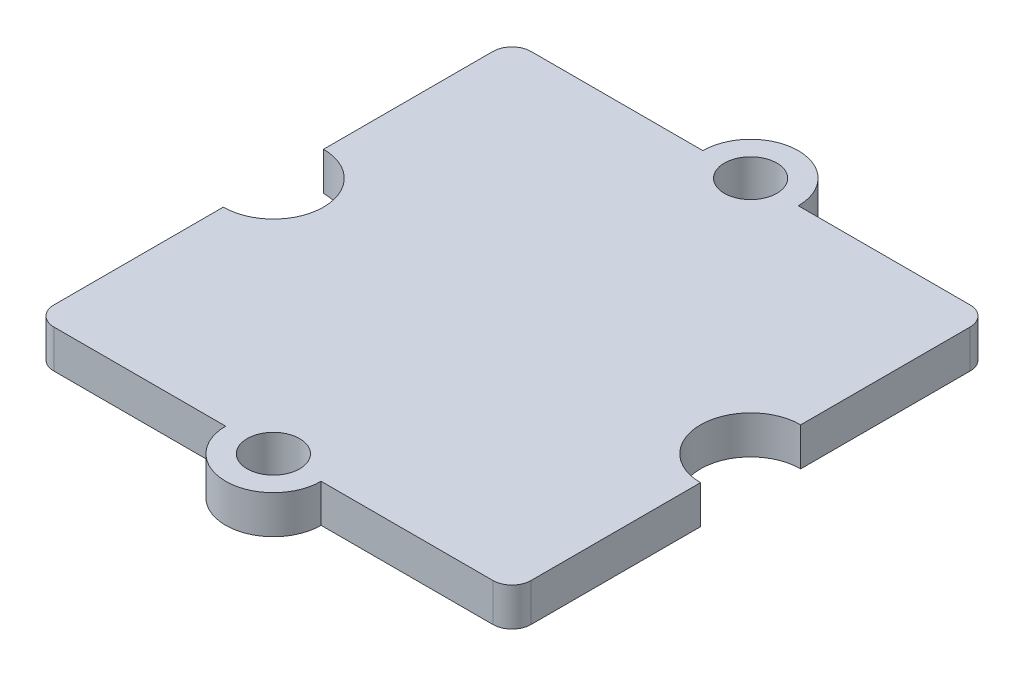
ISO-10303-21;
HEADER;
FILE_DESCRIPTION(('STEP AP214'),'2;1');
FILE_NAME('part.step','',(''),(''),'','','');
FILE_SCHEMA(('AUTOMOTIVE_DESIGN { 1 0 10303 214 1 1 1 1 }'));
ENDSEC;
DATA;
#1=APPLICATION_CONTEXT('core data for automotive mechanical design processes');
#2=APPLICATION_PROTOCOL_DEFINITION('international standard','automotive_design',2000,#1);
#3=PRODUCT_CONTEXT('',#1,'mechanical');
#4=PRODUCT('Part','Part','',(#3));
#5=PRODUCT_RELATED_PRODUCT_CATEGORY('part','',(#4));
#6=PRODUCT_DEFINITION_FORMATION('','',#4);
#7=PRODUCT_DEFINITION_CONTEXT('part definition',#1,'design');
#8=PRODUCT_DEFINITION('design','',#6,#7);
#9=PRODUCT_DEFINITION_SHAPE('','',#8);
#10=(LENGTH_UNIT() NAMED_UNIT(*) SI_UNIT(.MILLI.,.METRE.));
#11=(NAMED_UNIT(*) PLANE_ANGLE_UNIT() SI_UNIT($,.RADIAN.));
#12=(NAMED_UNIT(*) SI_UNIT($,.STERADIAN.) SOLID_ANGLE_UNIT());
#13=UNCERTAINTY_MEASURE_WITH_UNIT(LENGTH_MEASURE(1.E-05),#10,'distance_accuracy_value','');
#14=(GEOMETRIC_REPRESENTATION_CONTEXT(3) GLOBAL_UNCERTAINTY_ASSIGNED_CONTEXT((#13)) GLOBAL_UNIT_ASSIGNED_CONTEXT((#10,
#11,#12)) REPRESENTATION_CONTEXT('',''));
#15=CARTESIAN_POINT('',(0.,0.,0.));
#16=DIRECTION('',(0.,0.,1.));
#17=DIRECTION('',(1.,0.,0.));
#18=AXIS2_PLACEMENT_3D('',#15,#16,#17);
#19=CARTESIAN_POINT('',(0.,0.8,10.));
#20=DIRECTION('',(0.,-1.,0.));
#21=DIRECTION('',(0.,0.,-1.));
#22=AXIS2_PLACEMENT_3D('',#19,#20,#21);
#23=CYLINDRICAL_SURFACE('',#22,2.);
#24=CARTESIAN_POINT('',(0.,-0.8,10.));
#25=DIRECTION('',(0.,1.,0.));
#26=DIRECTION('',(0.,0.,1.));
#27=AXIS2_PLACEMENT_3D('',#24,#25,#26);
#28=CIRCLE('',#27,2.);
#29=CARTESIAN_POINT('',(-2.,-0.8,10.));
#30=VERTEX_POINT('',#29);
#31=CARTESIAN_POINT('',(2.,-0.8,10.));
#32=VERTEX_POINT('',#31);
#33=EDGE_CURVE('E189',#30,#32,#28,.T.);
#34=ORIENTED_EDGE('',*,*,#33,.T.);
#35=DIRECTION('',(0.,-1.,0.));
#36=VECTOR('',#35,1.);
#37=CARTESIAN_POINT('',(2.,0.8,10.));
#38=LINE('',#37,#36);
#39=CARTESIAN_POINT('',(2.,0.8,10.));
#40=VERTEX_POINT('',#39);
#41=EDGE_CURVE('E11',#40,#32,#38,.T.);
#42=ORIENTED_EDGE('',*,*,#41,.F.);
#43=CARTESIAN_POINT('',(0.,0.8,10.));
#44=DIRECTION('',(0.,1.,0.));
#45=DIRECTION('',(0.,0.,1.));
#46=AXIS2_PLACEMENT_3D('',#43,#44,#45);
#47=CIRCLE('',#46,2.);
#48=CARTESIAN_POINT('',(-2.,0.8,10.));
#49=VERTEX_POINT('',#48);
#50=EDGE_CURVE('E230',#49,#40,#47,.T.);
#51=ORIENTED_EDGE('',*,*,#50,.F.);
#52=DIRECTION('',(0.,-1.,0.));
#53=VECTOR('',#52,1.);
#54=CARTESIAN_POINT('',(-2.,0.8,10.));
#55=LINE('',#54,#53);
#56=EDGE_CURVE('E188',#49,#30,#55,.T.);
#57=ORIENTED_EDGE('',*,*,#56,.T.);
#58=EDGE_LOOP('',(#34,#42,#51,#57));
#59=FACE_BOUND('',#58,.T.);
#60=ADVANCED_FACE('F38',(#59),#23,.T.);
#61=CARTESIAN_POINT('',(0.,0.8,10.));
#62=DIRECTION('',(0.,0.,-1.));
#63=DIRECTION('',(-1.,0.,0.));
#64=AXIS2_PLACEMENT_3D('',#61,#62,#63);
#65=PLANE('',#64);
#66=DIRECTION('',(1.,0.,0.));
#67=VECTOR('',#66,1.);
#68=CARTESIAN_POINT('',(0.,-0.8,10.));
#69=LINE('',#68,#67);
#70=CARTESIAN_POINT('',(9.2,-0.8,10.));
#71=VERTEX_POINT('',#70);
#72=EDGE_CURVE('E192',#32,#71,#69,.T.);
#73=ORIENTED_EDGE('',*,*,#72,.T.);
#74=DIRECTION('',(0.,-1.,0.));
#75=VECTOR('',#74,1.);
#76=CARTESIAN_POINT('',(9.2,0.8,10.));
#77=LINE('',#76,#75);
#78=CARTESIAN_POINT('',(9.2,0.8,10.));
#79=VERTEX_POINT('',#78);
#80=EDGE_CURVE('E46',#79,#71,#77,.T.);
#81=ORIENTED_EDGE('',*,*,#80,.F.);
#82=DIRECTION('',(1.,0.,0.));
#83=VECTOR('',#82,1.);
#84=CARTESIAN_POINT('',(0.,0.8,10.));
#85=LINE('',#84,#83);
#86=EDGE_CURVE('E117',#40,#79,#85,.T.);
#87=ORIENTED_EDGE('',*,*,#86,.F.);
#88=ORIENTED_EDGE('',*,*,#41,.T.);
#89=EDGE_LOOP('',(#73,#81,#87,#88));
#90=FACE_BOUND('',#89,.T.);
#91=ADVANCED_FACE('F310',(#90),#65,.F.);
#92=CARTESIAN_POINT('',(9.2,0.8,9.2));
#93=DIRECTION('',(0.,-1.,0.));
#94=DIRECTION('',(0.,0.,-1.));
#95=AXIS2_PLACEMENT_3D('',#92,#93,#94);
#96=CYLINDRICAL_SURFACE('',#95,0.800000000000001);
#97=CARTESIAN_POINT('',(9.2,-0.8,9.2));
#98=DIRECTION('',(0.,1.,0.));
#99=DIRECTION('',(0.,0.,1.));
#100=AXIS2_PLACEMENT_3D('',#97,#98,#99);
#101=CIRCLE('',#100,0.800000000000001);
#102=CARTESIAN_POINT('',(10.,-0.8,9.2));
#103=VERTEX_POINT('',#102);
#104=EDGE_CURVE('E194',#71,#103,#101,.T.);
#105=ORIENTED_EDGE('',*,*,#104,.T.);
#106=DIRECTION('',(0.,-1.,0.));
#107=VECTOR('',#106,1.);
#108=CARTESIAN_POINT('',(10.,0.8,9.2));
#109=LINE('',#108,#107);
#110=CARTESIAN_POINT('',(10.,0.8,9.2));
#111=VERTEX_POINT('',#110);
#112=EDGE_CURVE('E252',#111,#103,#109,.T.);
#113=ORIENTED_EDGE('',*,*,#112,.F.);
#114=CARTESIAN_POINT('',(9.2,0.8,9.2));
#115=DIRECTION('',(0.,1.,0.));
#116=DIRECTION('',(0.,0.,1.));
#117=AXIS2_PLACEMENT_3D('',#114,#115,#116);
#118=CIRCLE('',#117,0.800000000000001);
#119=EDGE_CURVE('E260',#79,#111,#118,.T.);
#120=ORIENTED_EDGE('',*,*,#119,.F.);
#121=ORIENTED_EDGE('',*,*,#80,.T.);
#122=EDGE_LOOP('',(#105,#113,#120,#121));
#123=FACE_BOUND('',#122,.T.);
#124=ADVANCED_FACE('F258',(#123),#96,.T.);
#125=CARTESIAN_POINT('',(10.,0.8,0.));
#126=DIRECTION('',(-1.,0.,0.));
#127=DIRECTION('',(0.,0.,1.));
#128=AXIS2_PLACEMENT_3D('',#125,#126,#127);
#129=PLANE('',#128);
#130=DIRECTION('',(0.,0.,-1.));
#131=VECTOR('',#130,1.);
#132=CARTESIAN_POINT('',(10.,-0.8,0.));
#133=LINE('',#132,#131);
#134=CARTESIAN_POINT('',(10.,-0.8,2.10000000000001));
#135=VERTEX_POINT('',#134);
#136=EDGE_CURVE('E196',#103,#135,#133,.T.);
#137=ORIENTED_EDGE('',*,*,#136,.T.);
#138=DIRECTION('',(0.,-1.,0.));
#139=VECTOR('',#138,1.);
#140=CARTESIAN_POINT('',(10.,0.8,2.10000000000001));
#141=LINE('',#140,#139);
#142=CARTESIAN_POINT('',(10.,0.8,2.10000000000001));
#143=VERTEX_POINT('',#142);
#144=EDGE_CURVE('E250',#143,#135,#141,.T.);
#145=ORIENTED_EDGE('',*,*,#144,.F.);
#146=DIRECTION('',(0.,0.,-1.));
#147=VECTOR('',#146,1.);
#148=CARTESIAN_POINT('',(10.,0.8,0.));
#149=LINE('',#148,#147);
#150=EDGE_CURVE('E273',#111,#143,#149,.T.);
#151=ORIENTED_EDGE('',*,*,#150,.F.);
#152=ORIENTED_EDGE('',*,*,#112,.T.);
#153=EDGE_LOOP('',(#137,#145,#151,#152));
#154=FACE_BOUND('',#153,.T.);
#155=ADVANCED_FACE('F270',(#154),#129,.F.);
#156=CARTESIAN_POINT('',(10.,0.8,0.));
#157=DIRECTION('',(0.,-1.,0.));
#158=DIRECTION('',(0.,0.,-1.));
#159=AXIS2_PLACEMENT_3D('',#156,#157,#158);
#160=CYLINDRICAL_SURFACE('',#159,2.1);
#161=CARTESIAN_POINT('',(10.,-0.8,0.));
#162=DIRECTION('',(0.,1.,0.));
#163=DIRECTION('',(0.,0.,1.));
#164=AXIS2_PLACEMENT_3D('',#161,#162,#163);
#165=CIRCLE('',#164,2.1);
#166=CARTESIAN_POINT('',(10.,-0.8,-2.09999999999999));
#167=VERTEX_POINT('',#166);
#168=EDGE_CURVE('E199',#167,#135,#165,.T.);
#169=ORIENTED_EDGE('',*,*,#168,.F.);
#170=DIRECTION('',(0.,-1.,0.));
#171=VECTOR('',#170,1.);
#172=CARTESIAN_POINT('',(10.,0.8,-2.09999999999999));
#173=LINE('',#172,#171);
#174=CARTESIAN_POINT('',(10.,0.8,-2.09999999999999));
#175=VERTEX_POINT('',#174);
#176=EDGE_CURVE('E248',#175,#167,#173,.T.);
#177=ORIENTED_EDGE('',*,*,#176,.F.);
#178=CARTESIAN_POINT('',(10.,0.8,0.));
#179=DIRECTION('',(0.,1.,0.));
#180=DIRECTION('',(0.,0.,1.));
#181=AXIS2_PLACEMENT_3D('',#178,#179,#180);
#182=CIRCLE('',#181,2.1);
#183=EDGE_CURVE('E275',#175,#143,#182,.T.);
#184=ORIENTED_EDGE('',*,*,#183,.T.);
#185=ORIENTED_EDGE('',*,*,#144,.T.);
#186=EDGE_LOOP('',(#169,#177,#184,#185));
#187=FACE_BOUND('',#186,.T.);
#188=ADVANCED_FACE('F339',(#187),#160,.F.);
#189=CARTESIAN_POINT('',(10.,-0.8,-9.20000000000001));
#190=VERTEX_POINT('',#189);
#191=EDGE_CURVE('E200',#167,#190,#133,.T.);
#192=ORIENTED_EDGE('',*,*,#191,.T.);
#193=DIRECTION('',(0.,-1.,0.));
#194=VECTOR('',#193,1.);
#195=CARTESIAN_POINT('',(10.,0.8,-9.20000000000001));
#196=LINE('',#195,#194);
#197=CARTESIAN_POINT('',(10.,0.8,-9.20000000000001));
#198=VERTEX_POINT('',#197);
#199=EDGE_CURVE('E246',#198,#190,#196,.T.);
#200=ORIENTED_EDGE('',*,*,#199,.F.);
#201=EDGE_CURVE('E277',#175,#198,#149,.T.);
#202=ORIENTED_EDGE('',*,*,#201,.F.);
#203=ORIENTED_EDGE('',*,*,#176,.T.);
#204=EDGE_LOOP('',(#192,#200,#202,#203));
#205=FACE_BOUND('',#204,.T.);
#206=ADVANCED_FACE('F341',(#205),#129,.F.);
#207=CARTESIAN_POINT('',(9.2,0.8,-9.20000000000001));
#208=DIRECTION('',(0.,-1.,0.));
#209=DIRECTION('',(0.,0.,-1.));
#210=AXIS2_PLACEMENT_3D('',#207,#208,#209);
#211=CYLINDRICAL_SURFACE('',#210,0.800000000000002);
#212=CARTESIAN_POINT('',(9.2,-0.8,-9.20000000000001));
#213=DIRECTION('',(0.,1.,0.));
#214=DIRECTION('',(0.,0.,1.));
#215=AXIS2_PLACEMENT_3D('',#212,#213,#214);
#216=CIRCLE('',#215,0.800000000000002);
#217=CARTESIAN_POINT('',(9.2,-0.8,-10.));
#218=VERTEX_POINT('',#217);
#219=EDGE_CURVE('E203',#218,#190,#216,.F.);
#220=ORIENTED_EDGE('',*,*,#219,.F.);
#221=DIRECTION('',(0.,-1.,0.));
#222=VECTOR('',#221,1.);
#223=CARTESIAN_POINT('',(9.2,0.8,-10.));
#224=LINE('',#223,#222);
#225=CARTESIAN_POINT('',(9.2,0.8,-10.));
#226=VERTEX_POINT('',#225);
#227=EDGE_CURVE('E244',#226,#218,#224,.T.);
#228=ORIENTED_EDGE('',*,*,#227,.F.);
#229=CARTESIAN_POINT('',(9.2,0.8,-9.20000000000001));
#230=DIRECTION('',(0.,1.,0.));
#231=DIRECTION('',(0.,0.,1.));
#232=AXIS2_PLACEMENT_3D('',#229,#230,#231);
#233=CIRCLE('',#232,0.800000000000002);
#234=EDGE_CURVE('E280',#226,#198,#233,.F.);
#235=ORIENTED_EDGE('',*,*,#234,.T.);
#236=ORIENTED_EDGE('',*,*,#199,.T.);
#237=EDGE_LOOP('',(#220,#228,#235,#236));
#238=FACE_BOUND('',#237,.T.);
#239=ADVANCED_FACE('F354',(#238),#211,.T.);
#240=CARTESIAN_POINT('',(0.,0.8,-10.));
#241=DIRECTION('',(0.,0.,-1.));
#242=DIRECTION('',(-1.,0.,0.));
#243=AXIS2_PLACEMENT_3D('',#240,#241,#242);
#244=PLANE('',#243);
#245=DIRECTION('',(1.,0.,0.));
#246=VECTOR('',#245,1.);
#247=CARTESIAN_POINT('',(0.,-0.8,-10.));
#248=LINE('',#247,#246);
#249=CARTESIAN_POINT('',(2.,-0.8,-10.));
#250=VERTEX_POINT('',#249);
#251=EDGE_CURVE('E206',#250,#218,#248,.T.);
#252=ORIENTED_EDGE('',*,*,#251,.F.);
#253=DIRECTION('',(0.,-1.,0.));
#254=VECTOR('',#253,1.);
#255=CARTESIAN_POINT('',(2.,0.8,-10.));
#256=LINE('',#255,#254);
#257=CARTESIAN_POINT('',(2.,0.8,-10.));
#258=VERTEX_POINT('',#257);
#259=EDGE_CURVE('E242',#258,#250,#256,.T.);
#260=ORIENTED_EDGE('',*,*,#259,.F.);
#261=DIRECTION('',(1.,0.,0.));
#262=VECTOR('',#261,1.);
#263=CARTESIAN_POINT('',(0.,0.8,-10.));
#264=LINE('',#263,#262);
#265=EDGE_CURVE('E285',#258,#226,#264,.T.);
#266=ORIENTED_EDGE('',*,*,#265,.T.);
#267=ORIENTED_EDGE('',*,*,#227,.T.);
#268=EDGE_LOOP('',(#252,#260,#266,#267));
#269=FACE_BOUND('',#268,.T.);
#270=ADVANCED_FACE('F361',(#269),#244,.T.);
#271=CARTESIAN_POINT('',(0.,0.8,-9.99999999999999));
#272=DIRECTION('',(0.,-1.,0.));
#273=DIRECTION('',(0.,0.,-1.));
#274=AXIS2_PLACEMENT_3D('',#271,#272,#273);
#275=CYLINDRICAL_SURFACE('',#274,2.);
#276=CARTESIAN_POINT('',(0.,-0.8,-9.99999999999999));
#277=DIRECTION('',(0.,1.,0.));
#278=DIRECTION('',(0.,0.,1.));
#279=AXIS2_PLACEMENT_3D('',#276,#277,#278);
#280=CIRCLE('',#279,2.);
#281=CARTESIAN_POINT('',(-2.,-0.8,-10.));
#282=VERTEX_POINT('',#281);
#283=EDGE_CURVE('E209',#250,#282,#280,.T.);
#284=ORIENTED_EDGE('',*,*,#283,.T.);
#285=DIRECTION('',(0.,-1.,0.));
#286=VECTOR('',#285,1.);
#287=CARTESIAN_POINT('',(-2.,0.8,-10.));
#288=LINE('',#287,#286);
#289=CARTESIAN_POINT('',(-2.,0.8,-10.));
#290=VERTEX_POINT('',#289);
#291=EDGE_CURVE('E240',#290,#282,#288,.T.);
#292=ORIENTED_EDGE('',*,*,#291,.F.);
#293=CARTESIAN_POINT('',(0.,0.8,-9.99999999999999));
#294=DIRECTION('',(0.,1.,0.));
#295=DIRECTION('',(0.,0.,1.));
#296=AXIS2_PLACEMENT_3D('',#293,#294,#295);
#297=CIRCLE('',#296,2.);
#298=EDGE_CURVE('E289',#258,#290,#297,.T.);
#299=ORIENTED_EDGE('',*,*,#298,.F.);
#300=ORIENTED_EDGE('',*,*,#259,.T.);
#301=EDGE_LOOP('',(#284,#292,#299,#300));
#302=FACE_BOUND('',#301,.T.);
#303=ADVANCED_FACE('F368',(#302),#275,.T.);
#304=CARTESIAN_POINT('',(-9.2,-0.8,-10.));
#305=VERTEX_POINT('',#304);
#306=EDGE_CURVE('E210',#305,#282,#248,.T.);
#307=ORIENTED_EDGE('',*,*,#306,.F.);
#308=DIRECTION('',(0.,-1.,0.));
#309=VECTOR('',#308,1.);
#310=CARTESIAN_POINT('',(-9.2,0.8,-10.));
#311=LINE('',#310,#309);
#312=CARTESIAN_POINT('',(-9.2,0.8,-10.));
#313=VERTEX_POINT('',#312);
#314=EDGE_CURVE('E238',#313,#305,#311,.T.);
#315=ORIENTED_EDGE('',*,*,#314,.F.);
#316=EDGE_CURVE('E291',#313,#290,#264,.T.);
#317=ORIENTED_EDGE('',*,*,#316,.T.);
#318=ORIENTED_EDGE('',*,*,#291,.T.);
#319=EDGE_LOOP('',(#307,#315,#317,#318));
#320=FACE_BOUND('',#319,.T.);
#321=ADVANCED_FACE('F371',(#320),#244,.T.);
#322=CARTESIAN_POINT('',(-9.2,0.8,-9.20000000000001));
#323=DIRECTION('',(0.,-1.,0.));
#324=DIRECTION('',(0.,0.,-1.));
#325=AXIS2_PLACEMENT_3D('',#322,#323,#324);
#326=CYLINDRICAL_SURFACE('',#325,0.800000000000002);
#327=CARTESIAN_POINT('',(-9.2,-0.8,-9.20000000000001));
#328=DIRECTION('',(0.,1.,0.));
#329=DIRECTION('',(0.,0.,1.));
#330=AXIS2_PLACEMENT_3D('',#327,#328,#329);
#331=CIRCLE('',#330,0.800000000000002);
#332=CARTESIAN_POINT('',(-10.,-0.8,-9.20000000000001));
#333=VERTEX_POINT('',#332);
#334=EDGE_CURVE('E213',#333,#305,#331,.F.);
#335=ORIENTED_EDGE('',*,*,#334,.F.);
#336=DIRECTION('',(0.,-1.,0.));
#337=VECTOR('',#336,1.);
#338=CARTESIAN_POINT('',(-10.,0.8,-9.20000000000001));
#339=LINE('',#338,#337);
#340=CARTESIAN_POINT('',(-10.,0.8,-9.20000000000001));
#341=VERTEX_POINT('',#340);
#342=EDGE_CURVE('E236',#341,#333,#339,.T.);
#343=ORIENTED_EDGE('',*,*,#342,.F.);
#344=CARTESIAN_POINT('',(-9.2,0.8,-9.20000000000001));
#345=DIRECTION('',(0.,1.,0.));
#346=DIRECTION('',(0.,0.,1.));
#347=AXIS2_PLACEMENT_3D('',#344,#345,#346);
#348=CIRCLE('',#347,0.800000000000002);
#349=EDGE_CURVE('E294',#341,#313,#348,.F.);
#350=ORIENTED_EDGE('',*,*,#349,.T.);
#351=ORIENTED_EDGE('',*,*,#314,.T.);
#352=EDGE_LOOP('',(#335,#343,#350,#351));
#353=FACE_BOUND('',#352,.T.);
#354=ADVANCED_FACE('F384',(#353),#326,.T.);
#355=CARTESIAN_POINT('',(-10.,0.8,0.));
#356=DIRECTION('',(-1.,0.,0.));
#357=DIRECTION('',(0.,0.,1.));
#358=AXIS2_PLACEMENT_3D('',#355,#356,#357);
#359=PLANE('',#358);
#360=DIRECTION('',(0.,0.,-1.));
#361=VECTOR('',#360,1.);
#362=CARTESIAN_POINT('',(-10.,-0.8,0.));
#363=LINE('',#362,#361);
#364=CARTESIAN_POINT('',(-10.,-0.8,-2.09999999999999));
#365=VERTEX_POINT('',#364);
#366=EDGE_CURVE('E216',#365,#333,#363,.T.);
#367=ORIENTED_EDGE('',*,*,#366,.F.);
#368=DIRECTION('',(0.,-1.,0.));
#369=VECTOR('',#368,1.);
#370=CARTESIAN_POINT('',(-10.,0.8,-2.09999999999999));
#371=LINE('',#370,#369);
#372=CARTESIAN_POINT('',(-10.,0.8,-2.09999999999999));
#373=VERTEX_POINT('',#372);
#374=EDGE_CURVE('E234',#373,#365,#371,.T.);
#375=ORIENTED_EDGE('',*,*,#374,.F.);
#376=DIRECTION('',(0.,0.,-1.));
#377=VECTOR('',#376,1.);
#378=CARTESIAN_POINT('',(-10.,0.8,0.));
#379=LINE('',#378,#377);
#380=EDGE_CURVE('E176',#373,#341,#379,.T.);
#381=ORIENTED_EDGE('',*,*,#380,.T.);
#382=ORIENTED_EDGE('',*,*,#342,.T.);
#383=EDGE_LOOP('',(#367,#375,#381,#382));
#384=FACE_BOUND('',#383,.T.);
#385=ADVANCED_FACE('F391',(#384),#359,.T.);
#386=CARTESIAN_POINT('',(-10.,0.8,0.));
#387=DIRECTION('',(0.,-1.,0.));
#388=DIRECTION('',(0.,0.,-1.));
#389=AXIS2_PLACEMENT_3D('',#386,#387,#388);
#390=CYLINDRICAL_SURFACE('',#389,2.1);
#391=CARTESIAN_POINT('',(-10.,-0.8,0.));
#392=DIRECTION('',(0.,1.,0.));
#393=DIRECTION('',(0.,0.,1.));
#394=AXIS2_PLACEMENT_3D('',#391,#392,#393);
#395=CIRCLE('',#394,2.1);
#396=CARTESIAN_POINT('',(-10.,-0.8,2.10000000000001));
#397=VERTEX_POINT('',#396);
#398=EDGE_CURVE('E219',#397,#365,#395,.T.);
#399=ORIENTED_EDGE('',*,*,#398,.F.);
#400=DIRECTION('',(0.,-1.,0.));
#401=VECTOR('',#400,1.);
#402=CARTESIAN_POINT('',(-10.,0.8,2.10000000000001));
#403=LINE('',#402,#401);
#404=CARTESIAN_POINT('',(-10.,0.8,2.10000000000001));
#405=VERTEX_POINT('',#404);
#406=EDGE_CURVE('E166',#405,#397,#403,.T.);
#407=ORIENTED_EDGE('',*,*,#406,.F.);
#408=CARTESIAN_POINT('',(-10.,0.8,0.));
#409=DIRECTION('',(0.,1.,0.));
#410=DIRECTION('',(0.,0.,1.));
#411=AXIS2_PLACEMENT_3D('',#408,#409,#410);
#412=CIRCLE('',#411,2.1);
#413=EDGE_CURVE('E174',#405,#373,#412,.T.);
#414=ORIENTED_EDGE('',*,*,#413,.T.);
#415=ORIENTED_EDGE('',*,*,#374,.T.);
#416=EDGE_LOOP('',(#399,#407,#414,#415));
#417=FACE_BOUND('',#416,.T.);
#418=ADVANCED_FACE('F300',(#417),#390,.F.);
#419=CARTESIAN_POINT('',(-10.,-0.8,9.2));
#420=VERTEX_POINT('',#419);
#421=EDGE_CURVE('E161',#420,#397,#363,.T.);
#422=ORIENTED_EDGE('',*,*,#421,.F.);
#423=DIRECTION('',(0.,-1.,0.));
#424=VECTOR('',#423,1.);
#425=CARTESIAN_POINT('',(-10.,0.8,9.2));
#426=LINE('',#425,#424);
#427=CARTESIAN_POINT('',(-10.,0.8,9.2));
#428=VERTEX_POINT('',#427);
#429=EDGE_CURVE('E156',#428,#420,#426,.T.);
#430=ORIENTED_EDGE('',*,*,#429,.F.);
#431=EDGE_CURVE('E159',#428,#405,#379,.T.);
#432=ORIENTED_EDGE('',*,*,#431,.T.);
#433=ORIENTED_EDGE('',*,*,#406,.T.);
#434=EDGE_LOOP('',(#422,#430,#432,#433));
#435=FACE_BOUND('',#434,.T.);
#436=ADVANCED_FACE('F158',(#435),#359,.T.);
#437=CARTESIAN_POINT('',(-9.19999999999999,0.8,9.2));
#438=DIRECTION('',(0.,-1.,0.));
#439=DIRECTION('',(0.,0.,-1.));
#440=AXIS2_PLACEMENT_3D('',#437,#438,#439);
#441=CYLINDRICAL_SURFACE('',#440,0.800000000000001);
#442=CARTESIAN_POINT('',(-9.19999999999999,-0.8,9.2));
#443=DIRECTION('',(0.,1.,0.));
#444=DIRECTION('',(0.,0.,1.));
#445=AXIS2_PLACEMENT_3D('',#442,#443,#444);
#446=CIRCLE('',#445,0.800000000000001);
#447=CARTESIAN_POINT('',(-9.19999999999999,-0.8,10.));
#448=VERTEX_POINT('',#447);
#449=EDGE_CURVE('E222',#448,#420,#446,.F.);
#450=ORIENTED_EDGE('',*,*,#449,.F.);
#451=DIRECTION('',(0.,-1.,0.));
#452=VECTOR('',#451,1.);
#453=CARTESIAN_POINT('',(-9.19999999999999,0.8,10.));
#454=LINE('',#453,#452);
#455=CARTESIAN_POINT('',(-9.19999999999999,0.8,10.));
#456=VERTEX_POINT('',#455);
#457=EDGE_CURVE('E106',#456,#448,#454,.T.);
#458=ORIENTED_EDGE('',*,*,#457,.F.);
#459=CARTESIAN_POINT('',(-9.19999999999999,0.8,9.2));
#460=DIRECTION('',(0.,1.,0.));
#461=DIRECTION('',(0.,0.,1.));
#462=AXIS2_PLACEMENT_3D('',#459,#460,#461);
#463=CIRCLE('',#462,0.800000000000001);
#464=EDGE_CURVE('E171',#456,#428,#463,.F.);
#465=ORIENTED_EDGE('',*,*,#464,.T.);
#466=ORIENTED_EDGE('',*,*,#429,.T.);
#467=EDGE_LOOP('',(#450,#458,#465,#466));
#468=FACE_BOUND('',#467,.T.);
#469=ADVANCED_FACE('F177',(#468),#441,.T.);
#470=CARTESIAN_POINT('',(0.,0.8,-9.99999999999999));
#471=DIRECTION('',(0.,-1.,0.));
#472=DIRECTION('',(0.,0.,-1.));
#473=AXIS2_PLACEMENT_3D('',#470,#471,#472);
#474=CYLINDRICAL_SURFACE('',#473,1.1);
#475=CARTESIAN_POINT('',(0.,0.8,-9.99999999999999));
#476=DIRECTION('',(0.,1.,0.));
#477=DIRECTION('',(0.,0.,1.));
#478=AXIS2_PLACEMENT_3D('',#475,#476,#477);
#479=CIRCLE('',#478,1.1);
#480=CARTESIAN_POINT('',(0.,0.8,-8.9));
#481=VERTEX_POINT('',#480);
#482=EDGE_CURVE('E179',#481,#481,#479,.T.);
#483=ORIENTED_EDGE('',*,*,#482,.T.);
#484=EDGE_LOOP('',(#483));
#485=FACE_BOUND('',#484,.T.);
#486=CARTESIAN_POINT('',(0.,-0.8,-9.99999999999999));
#487=DIRECTION('',(0.,1.,0.));
#488=DIRECTION('',(0.,0.,1.));
#489=AXIS2_PLACEMENT_3D('',#486,#487,#488);
#490=CIRCLE('',#489,1.1);
#491=CARTESIAN_POINT('',(0.,-0.8,-8.9));
#492=VERTEX_POINT('',#491);
#493=EDGE_CURVE('E224',#492,#492,#490,.T.);
#494=ORIENTED_EDGE('',*,*,#493,.F.);
#495=EDGE_LOOP('',(#494));
#496=FACE_BOUND('',#495,.T.);
#497=ADVANCED_FACE('F308',(#485,#496),#474,.F.);
#498=EDGE_CURVE('E109',#448,#30,#69,.T.);
#499=ORIENTED_EDGE('',*,*,#498,.T.);
#500=ORIENTED_EDGE('',*,*,#56,.F.);
#501=EDGE_CURVE('E54',#456,#49,#85,.T.);
#502=ORIENTED_EDGE('',*,*,#501,.F.);
#503=ORIENTED_EDGE('',*,*,#457,.T.);
#504=EDGE_LOOP('',(#499,#500,#502,#503));
#505=FACE_BOUND('',#504,.T.);
#506=ADVANCED_FACE('F305',(#505),#65,.F.);
#507=CARTESIAN_POINT('',(0.,0.8,10.));
#508=DIRECTION('',(0.,-1.,0.));
#509=DIRECTION('',(0.,0.,-1.));
#510=AXIS2_PLACEMENT_3D('',#507,#508,#509);
#511=CYLINDRICAL_SURFACE('',#510,1.1);
#512=CARTESIAN_POINT('',(0.,0.8,10.));
#513=DIRECTION('',(0.,1.,0.));
#514=DIRECTION('',(0.,0.,1.));
#515=AXIS2_PLACEMENT_3D('',#512,#513,#514);
#516=CIRCLE('',#515,1.1);
#517=CARTESIAN_POINT('',(0.,0.8,11.1));
#518=VERTEX_POINT('',#517);
#519=EDGE_CURVE('E185',#518,#518,#516,.T.);
#520=ORIENTED_EDGE('',*,*,#519,.T.);
#521=EDGE_LOOP('',(#520));
#522=FACE_BOUND('',#521,.T.);
#523=CARTESIAN_POINT('',(0.,-0.8,10.));
#524=DIRECTION('',(0.,1.,0.));
#525=DIRECTION('',(0.,0.,1.));
#526=AXIS2_PLACEMENT_3D('',#523,#524,#525);
#527=CIRCLE('',#526,1.1);
#528=CARTESIAN_POINT('',(0.,-0.8,11.1));
#529=VERTEX_POINT('',#528);
#530=EDGE_CURVE('E227',#529,#529,#527,.T.);
#531=ORIENTED_EDGE('',*,*,#530,.F.);
#532=EDGE_LOOP('',(#531));
#533=FACE_BOUND('',#532,.T.);
#534=ADVANCED_FACE('F307',(#522,#533),#511,.F.);
#535=CARTESIAN_POINT('',(0.,0.8,0.));
#536=DIRECTION('',(0.,1.,0.));
#537=DIRECTION('',(0.,0.,1.));
#538=AXIS2_PLACEMENT_3D('',#535,#536,#537);
#539=PLANE('',#538);
#540=ORIENTED_EDGE('',*,*,#50,.T.);
#541=ORIENTED_EDGE('',*,*,#86,.T.);
#542=ORIENTED_EDGE('',*,*,#119,.T.);
#543=ORIENTED_EDGE('',*,*,#150,.T.);
#544=ORIENTED_EDGE('',*,*,#183,.F.);
#545=ORIENTED_EDGE('',*,*,#201,.T.);
#546=ORIENTED_EDGE('',*,*,#234,.F.);
#547=ORIENTED_EDGE('',*,*,#265,.F.);
#548=ORIENTED_EDGE('',*,*,#298,.T.);
#549=ORIENTED_EDGE('',*,*,#316,.F.);
#550=ORIENTED_EDGE('',*,*,#349,.F.);
#551=ORIENTED_EDGE('',*,*,#380,.F.);
#552=ORIENTED_EDGE('',*,*,#413,.F.);
#553=ORIENTED_EDGE('',*,*,#431,.F.);
#554=ORIENTED_EDGE('',*,*,#464,.F.);
#555=ORIENTED_EDGE('',*,*,#501,.T.);
#556=EDGE_LOOP('',(#540,#541,#542,#543,#544,#545,#546,#547,#548,#549,#550,#551,#552,#553,#554,#555));
#557=FACE_BOUND('',#556,.T.);
#558=ORIENTED_EDGE('',*,*,#482,.F.);
#559=EDGE_LOOP('',(#558));
#560=FACE_BOUND('',#559,.T.);
#561=ORIENTED_EDGE('',*,*,#519,.F.);
#562=EDGE_LOOP('',(#561));
#563=FACE_BOUND('',#562,.T.);
#564=ADVANCED_FACE('F169',(#557,#560,#563),#539,.T.);
#565=CARTESIAN_POINT('',(0.,-0.8,0.));
#566=DIRECTION('',(0.,1.,0.));
#567=DIRECTION('',(0.,0.,1.));
#568=AXIS2_PLACEMENT_3D('',#565,#566,#567);
#569=PLANE('',#568);
#570=ORIENTED_EDGE('',*,*,#33,.F.);
#571=ORIENTED_EDGE('',*,*,#498,.F.);
#572=ORIENTED_EDGE('',*,*,#449,.T.);
#573=ORIENTED_EDGE('',*,*,#421,.T.);
#574=ORIENTED_EDGE('',*,*,#398,.T.);
#575=ORIENTED_EDGE('',*,*,#366,.T.);
#576=ORIENTED_EDGE('',*,*,#334,.T.);
#577=ORIENTED_EDGE('',*,*,#306,.T.);
#578=ORIENTED_EDGE('',*,*,#283,.F.);
#579=ORIENTED_EDGE('',*,*,#251,.T.);
#580=ORIENTED_EDGE('',*,*,#219,.T.);
#581=ORIENTED_EDGE('',*,*,#191,.F.);
#582=ORIENTED_EDGE('',*,*,#168,.T.);
#583=ORIENTED_EDGE('',*,*,#136,.F.);
#584=ORIENTED_EDGE('',*,*,#104,.F.);
#585=ORIENTED_EDGE('',*,*,#72,.F.);
#586=EDGE_LOOP('',(#570,#571,#572,#573,#574,#575,#576,#577,#578,#579,#580,#581,#582,#583,#584,#585));
#587=FACE_BOUND('',#586,.T.);
#588=ORIENTED_EDGE('',*,*,#493,.T.);
#589=EDGE_LOOP('',(#588));
#590=FACE_BOUND('',#589,.T.);
#591=ORIENTED_EDGE('',*,*,#530,.T.);
#592=EDGE_LOOP('',(#591));
#593=FACE_BOUND('',#592,.T.);
#594=ADVANCED_FACE('F264',(#587,#590,#593),#569,.F.);
#595=CLOSED_SHELL('',(#60,#91,#124,#155,#188,#206,#239,#270,#303,#321,#354,#385,#418,#436,#469,
#497,#506,#534,#564,#594));
#596=MANIFOLD_SOLID_BREP('B2',#595);
#597=ADVANCED_BREP_SHAPE_REPRESENTATION('',(#18,#596),#14);
#598=SHAPE_DEFINITION_REPRESENTATION(#9,#597);
ENDSEC;
END-ISO-10303-21;
